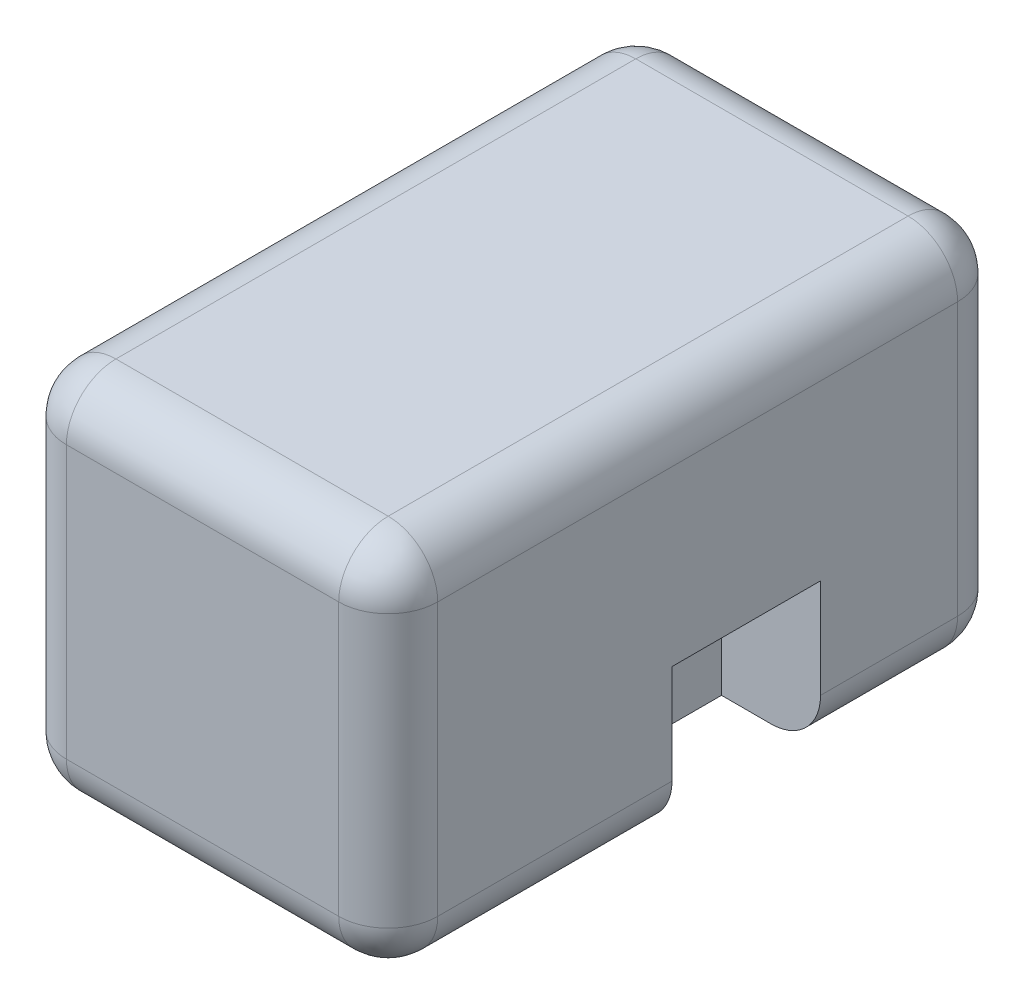
ISO-10303-21;
HEADER;
FILE_DESCRIPTION(('STEP AP214'),'2;1');
FILE_NAME('part.step','',(''),(''),'','','');
FILE_SCHEMA(('AUTOMOTIVE_DESIGN { 1 0 10303 214 1 1 1 1 }'));
ENDSEC;
DATA;
#1=APPLICATION_CONTEXT('core data for automotive mechanical design processes');
#2=APPLICATION_PROTOCOL_DEFINITION('international standard','automotive_design',2000,#1);
#3=PRODUCT_CONTEXT('',#1,'mechanical');
#4=PRODUCT('Part','Part','',(#3));
#5=PRODUCT_RELATED_PRODUCT_CATEGORY('part','',(#4));
#6=PRODUCT_DEFINITION_FORMATION('','',#4);
#7=PRODUCT_DEFINITION_CONTEXT('part definition',#1,'design');
#8=PRODUCT_DEFINITION('design','',#6,#7);
#9=PRODUCT_DEFINITION_SHAPE('','',#8);
#10=(LENGTH_UNIT() NAMED_UNIT(*) SI_UNIT(.MILLI.,.METRE.));
#11=(NAMED_UNIT(*) PLANE_ANGLE_UNIT() SI_UNIT($,.RADIAN.));
#12=(NAMED_UNIT(*) SI_UNIT($,.STERADIAN.) SOLID_ANGLE_UNIT());
#13=UNCERTAINTY_MEASURE_WITH_UNIT(LENGTH_MEASURE(1.E-05),#10,'distance_accuracy_value','');
#14=(GEOMETRIC_REPRESENTATION_CONTEXT(3) GLOBAL_UNCERTAINTY_ASSIGNED_CONTEXT((#13)) GLOBAL_UNIT_ASSIGNED_CONTEXT((#10,
#11,#12)) REPRESENTATION_CONTEXT('',''));
#15=CARTESIAN_POINT('',(0.,0.,0.));
#16=DIRECTION('',(0.,0.,1.));
#17=DIRECTION('',(1.,0.,0.));
#18=AXIS2_PLACEMENT_3D('',#15,#16,#17);
#19=CARTESIAN_POINT('',(20.,20.,250.));
#20=DIRECTION('',(0.,0.,-1.));
#21=DIRECTION('',(-1.,0.,0.));
#22=AXIS2_PLACEMENT_3D('',#19,#20,#21);
#23=CYLINDRICAL_SURFACE('',#22,20.);
#24=CARTESIAN_POINT('',(20.,20.,75.5178824316422));
#25=DIRECTION('',(0.,0.,-1.));
#26=DIRECTION('',(0.,1.,0.));
#27=AXIS2_PLACEMENT_3D('',#24,#25,#26);
#28=CIRCLE('',#27,20.);
#29=CARTESIAN_POINT('',(0.,20.,75.5178824316422));
#30=VERTEX_POINT('',#29);
#31=CARTESIAN_POINT('',(20.,0.,75.5178824316422));
#32=VERTEX_POINT('',#31);
#33=EDGE_CURVE('E11',#30,#32,#28,.F.);
#34=ORIENTED_EDGE('',*,*,#33,.F.);
#35=DIRECTION('',(0.,0.,-1.));
#36=VECTOR('',#35,1.);
#37=CARTESIAN_POINT('',(0.,20.,250.));
#38=LINE('',#37,#36);
#39=CARTESIAN_POINT('',(0.,20.,20.));
#40=VERTEX_POINT('',#39);
#41=EDGE_CURVE('E297',#40,#30,#38,.F.);
#42=ORIENTED_EDGE('',*,*,#41,.F.);
#43=CARTESIAN_POINT('',(20.,20.,20.));
#44=DIRECTION('',(0.,0.,-1.));
#45=DIRECTION('',(-1.,0.,0.));
#46=AXIS2_PLACEMENT_3D('',#43,#44,#45);
#47=CIRCLE('',#46,20.);
#48=CARTESIAN_POINT('',(20.,0.,20.));
#49=VERTEX_POINT('',#48);
#50=EDGE_CURVE('E359',#40,#49,#47,.F.);
#51=ORIENTED_EDGE('',*,*,#50,.T.);
#52=DIRECTION('',(0.,0.,-1.));
#53=VECTOR('',#52,1.);
#54=CARTESIAN_POINT('',(20.,0.,250.));
#55=LINE('',#54,#53);
#56=EDGE_CURVE('E282',#32,#49,#55,.T.);
#57=ORIENTED_EDGE('',*,*,#56,.F.);
#58=EDGE_LOOP('',(#34,#42,#51,#57));
#59=FACE_BOUND('',#58,.T.);
#60=ADVANCED_FACE('F32',(#59),#23,.T.);
#61=CARTESIAN_POINT('',(0.,0.,250.));
#62=DIRECTION('',(0.,1.,0.));
#63=DIRECTION('',(0.,0.,1.));
#64=AXIS2_PLACEMENT_3D('',#61,#62,#63);
#65=PLANE('',#64);
#66=DIRECTION('',(0.,0.,1.));
#67=VECTOR('',#66,1.);
#68=CARTESIAN_POINT('',(40.,0.,75.5178824316422));
#69=LINE('',#68,#67);
#70=CARTESIAN_POINT('',(40.,0.,75.5178824316422));
#71=VERTEX_POINT('',#70);
#72=CARTESIAN_POINT('',(40.,0.,135.517882431642));
#73=VERTEX_POINT('',#72);
#74=EDGE_CURVE('E196',#71,#73,#69,.T.);
#75=ORIENTED_EDGE('',*,*,#74,.F.);
#76=DIRECTION('',(-1.,0.,0.));
#77=VECTOR('',#76,1.);
#78=CARTESIAN_POINT('',(40.,0.,75.5178824316422));
#79=LINE('',#78,#77);
#80=EDGE_CURVE('E181',#71,#32,#79,.T.);
#81=ORIENTED_EDGE('',*,*,#80,.T.);
#82=ORIENTED_EDGE('',*,*,#56,.T.);
#83=DIRECTION('',(1.,0.,0.));
#84=VECTOR('',#83,1.);
#85=CARTESIAN_POINT('',(150.,0.,20.));
#86=LINE('',#85,#84);
#87=CARTESIAN_POINT('',(130.,0.,20.));
#88=VERTEX_POINT('',#87);
#89=EDGE_CURVE('E285',#49,#88,#86,.T.);
#90=ORIENTED_EDGE('',*,*,#89,.T.);
#91=DIRECTION('',(0.,0.,-1.));
#92=VECTOR('',#91,1.);
#93=CARTESIAN_POINT('',(130.,0.,250.));
#94=LINE('',#93,#92);
#95=CARTESIAN_POINT('',(130.,0.,75.3647620548374));
#96=VERTEX_POINT('',#95);
#97=EDGE_CURVE('E288',#88,#96,#94,.F.);
#98=ORIENTED_EDGE('',*,*,#97,.T.);
#99=DIRECTION('',(-1.,0.,0.));
#100=VECTOR('',#99,1.);
#101=CARTESIAN_POINT('',(0.,0.,75.3647620548374));
#102=LINE('',#101,#100);
#103=CARTESIAN_POINT('',(110.,0.,75.3647620548374));
#104=VERTEX_POINT('',#103);
#105=EDGE_CURVE('E55',#96,#104,#102,.T.);
#106=ORIENTED_EDGE('',*,*,#105,.T.);
#107=DIRECTION('',(0.,0.,-1.));
#108=VECTOR('',#107,1.);
#109=CARTESIAN_POINT('',(110.,0.,250.));
#110=LINE('',#109,#108);
#111=CARTESIAN_POINT('',(110.,0.,135.364762054837));
#112=VERTEX_POINT('',#111);
#113=EDGE_CURVE('E374',#112,#104,#110,.T.);
#114=ORIENTED_EDGE('',*,*,#113,.F.);
#115=DIRECTION('',(-1.,0.,0.));
#116=VECTOR('',#115,1.);
#117=CARTESIAN_POINT('',(0.,0.,135.364762054837));
#118=LINE('',#117,#116);
#119=CARTESIAN_POINT('',(130.,0.,135.364762054837));
#120=VERTEX_POINT('',#119);
#121=EDGE_CURVE('E240',#120,#112,#118,.T.);
#122=ORIENTED_EDGE('',*,*,#121,.F.);
#123=CARTESIAN_POINT('',(130.,0.,230.));
#124=VERTEX_POINT('',#123);
#125=EDGE_CURVE('E287',#120,#124,#94,.F.);
#126=ORIENTED_EDGE('',*,*,#125,.T.);
#127=DIRECTION('',(1.,0.,0.));
#128=VECTOR('',#127,1.);
#129=CARTESIAN_POINT('',(0.,0.,230.));
#130=LINE('',#129,#128);
#131=CARTESIAN_POINT('',(20.,0.,230.));
#132=VERTEX_POINT('',#131);
#133=EDGE_CURVE('E291',#124,#132,#130,.F.);
#134=ORIENTED_EDGE('',*,*,#133,.T.);
#135=CARTESIAN_POINT('',(20.,0.,135.517882431642));
#136=VERTEX_POINT('',#135);
#137=EDGE_CURVE('E283',#132,#136,#55,.T.);
#138=ORIENTED_EDGE('',*,*,#137,.T.);
#139=DIRECTION('',(-1.,0.,0.));
#140=VECTOR('',#139,1.);
#141=CARTESIAN_POINT('',(40.,0.,135.517882431642));
#142=LINE('',#141,#140);
#143=EDGE_CURVE('E47',#73,#136,#142,.T.);
#144=ORIENTED_EDGE('',*,*,#143,.F.);
#145=EDGE_LOOP('',(#75,#81,#82,#90,#98,#106,#114,#122,#126,#134,#138,#144));
#146=FACE_BOUND('',#145,.T.);
#147=ADVANCED_FACE('F200',(#146),#65,.F.);
#148=CARTESIAN_POINT('',(150.,0.,250.));
#149=DIRECTION('',(-1.,0.,0.));
#150=DIRECTION('',(0.,0.,1.));
#151=AXIS2_PLACEMENT_3D('',#148,#149,#150);
#152=PLANE('',#151);
#153=DIRECTION('',(0.,1.,0.));
#154=VECTOR('',#153,1.);
#155=CARTESIAN_POINT('',(150.,-19.9306992564541,135.364762054837));
#156=LINE('',#155,#154);
#157=CARTESIAN_POINT('',(150.,20.,135.364762054837));
#158=VERTEX_POINT('',#157);
#159=CARTESIAN_POINT('',(150.,60.0693007435459,135.364762054837));
#160=VERTEX_POINT('',#159);
#161=EDGE_CURVE('E223',#158,#160,#156,.T.);
#162=ORIENTED_EDGE('',*,*,#161,.T.);
#163=DIRECTION('',(0.,0.,-1.));
#164=VECTOR('',#163,1.);
#165=CARTESIAN_POINT('',(150.,60.0693007435459,135.364762054837));
#166=LINE('',#165,#164);
#167=CARTESIAN_POINT('',(150.,60.0693007435459,75.3647620548374));
#168=VERTEX_POINT('',#167);
#169=EDGE_CURVE('E230',#160,#168,#166,.T.);
#170=ORIENTED_EDGE('',*,*,#169,.T.);
#171=DIRECTION('',(0.,1.,0.));
#172=VECTOR('',#171,1.);
#173=CARTESIAN_POINT('',(150.,-19.9306992564541,75.3647620548374));
#174=LINE('',#173,#172);
#175=CARTESIAN_POINT('',(150.,20.,75.3647620548374));
#176=VERTEX_POINT('',#175);
#177=EDGE_CURVE('E215',#176,#168,#174,.T.);
#178=ORIENTED_EDGE('',*,*,#177,.F.);
#179=DIRECTION('',(0.,0.,-1.));
#180=VECTOR('',#179,1.);
#181=CARTESIAN_POINT('',(150.,20.,250.));
#182=LINE('',#181,#180);
#183=CARTESIAN_POINT('',(150.,20.,20.));
#184=VERTEX_POINT('',#183);
#185=EDGE_CURVE('E253',#176,#184,#182,.T.);
#186=ORIENTED_EDGE('',*,*,#185,.T.);
#187=DIRECTION('',(0.,1.,0.));
#188=VECTOR('',#187,1.);
#189=CARTESIAN_POINT('',(150.,150.,20.));
#190=LINE('',#189,#188);
#191=CARTESIAN_POINT('',(150.,130.,20.));
#192=VERTEX_POINT('',#191);
#193=EDGE_CURVE('E257',#184,#192,#190,.T.);
#194=ORIENTED_EDGE('',*,*,#193,.T.);
#195=DIRECTION('',(0.,0.,-1.));
#196=VECTOR('',#195,1.);
#197=CARTESIAN_POINT('',(150.,130.,250.));
#198=LINE('',#197,#196);
#199=CARTESIAN_POINT('',(150.,130.,230.));
#200=VERTEX_POINT('',#199);
#201=EDGE_CURVE('E262',#192,#200,#198,.F.);
#202=ORIENTED_EDGE('',*,*,#201,.T.);
#203=DIRECTION('',(0.,1.,0.));
#204=VECTOR('',#203,1.);
#205=CARTESIAN_POINT('',(150.,0.,230.));
#206=LINE('',#205,#204);
#207=CARTESIAN_POINT('',(150.,20.,230.));
#208=VERTEX_POINT('',#207);
#209=EDGE_CURVE('E259',#200,#208,#206,.F.);
#210=ORIENTED_EDGE('',*,*,#209,.T.);
#211=EDGE_CURVE('E254',#208,#158,#182,.T.);
#212=ORIENTED_EDGE('',*,*,#211,.T.);
#213=EDGE_LOOP('',(#162,#170,#178,#186,#194,#202,#210,#212));
#214=FACE_BOUND('',#213,.T.);
#215=ADVANCED_FACE('F433',(#214),#152,.F.);
#216=CARTESIAN_POINT('',(130.,20.,250.));
#217=DIRECTION('',(0.,0.,-1.));
#218=DIRECTION('',(-1.,0.,0.));
#219=AXIS2_PLACEMENT_3D('',#216,#217,#218);
#220=CYLINDRICAL_SURFACE('',#219,20.);
#221=ORIENTED_EDGE('',*,*,#125,.F.);
#222=CARTESIAN_POINT('',(130.,20.,135.364762054837));
#223=DIRECTION('',(0.,0.,-1.));
#224=DIRECTION('',(-1.,0.,0.));
#225=AXIS2_PLACEMENT_3D('',#222,#223,#224);
#226=CIRCLE('',#225,20.);
#227=EDGE_CURVE('E371',#120,#158,#226,.F.);
#228=ORIENTED_EDGE('',*,*,#227,.T.);
#229=ORIENTED_EDGE('',*,*,#211,.F.);
#230=CARTESIAN_POINT('',(130.,20.,230.));
#231=DIRECTION('',(0.,0.,1.));
#232=DIRECTION('',(1.,0.,0.));
#233=AXIS2_PLACEMENT_3D('',#230,#231,#232);
#234=CIRCLE('',#233,20.);
#235=EDGE_CURVE('E318',#124,#208,#234,.T.);
#236=ORIENTED_EDGE('',*,*,#235,.F.);
#237=EDGE_LOOP('',(#221,#228,#229,#236));
#238=FACE_BOUND('',#237,.T.);
#239=ADVANCED_FACE('F450',(#238),#220,.T.);
#240=CARTESIAN_POINT('',(0.,0.,250.));
#241=DIRECTION('',(1.,0.,0.));
#242=DIRECTION('',(0.,0.,-1.));
#243=AXIS2_PLACEMENT_3D('',#240,#241,#242);
#244=PLANE('',#243);
#245=ORIENTED_EDGE('',*,*,#41,.T.);
#246=DIRECTION('',(0.,-1.,0.));
#247=VECTOR('',#246,1.);
#248=CARTESIAN_POINT('',(0.,60.,75.5178824316422));
#249=LINE('',#248,#247);
#250=CARTESIAN_POINT('',(0.,60.,75.5178824316422));
#251=VERTEX_POINT('',#250);
#252=EDGE_CURVE('E207',#251,#30,#249,.T.);
#253=ORIENTED_EDGE('',*,*,#252,.F.);
#254=DIRECTION('',(0.,0.,-1.));
#255=VECTOR('',#254,1.);
#256=CARTESIAN_POINT('',(0.,60.,75.5178824316422));
#257=LINE('',#256,#255);
#258=CARTESIAN_POINT('',(0.,60.,135.517882431642));
#259=VERTEX_POINT('',#258);
#260=EDGE_CURVE('E198',#259,#251,#257,.T.);
#261=ORIENTED_EDGE('',*,*,#260,.F.);
#262=DIRECTION('',(0.,1.,0.));
#263=VECTOR('',#262,1.);
#264=CARTESIAN_POINT('',(0.,60.,135.517882431642));
#265=LINE('',#264,#263);
#266=CARTESIAN_POINT('',(0.,20.,135.517882431642));
#267=VERTEX_POINT('',#266);
#268=EDGE_CURVE('E209',#267,#259,#265,.T.);
#269=ORIENTED_EDGE('',*,*,#268,.F.);
#270=CARTESIAN_POINT('',(0.,20.,230.));
#271=VERTEX_POINT('',#270);
#272=EDGE_CURVE('E296',#267,#271,#38,.F.);
#273=ORIENTED_EDGE('',*,*,#272,.T.);
#274=DIRECTION('',(0.,-1.,0.));
#275=VECTOR('',#274,1.);
#276=CARTESIAN_POINT('',(0.,0.,230.));
#277=LINE('',#276,#275);
#278=CARTESIAN_POINT('',(0.,130.,230.));
#279=VERTEX_POINT('',#278);
#280=EDGE_CURVE('E300',#271,#279,#277,.F.);
#281=ORIENTED_EDGE('',*,*,#280,.T.);
#282=DIRECTION('',(0.,0.,-1.));
#283=VECTOR('',#282,1.);
#284=CARTESIAN_POINT('',(0.,130.,250.));
#285=LINE('',#284,#283);
#286=CARTESIAN_POINT('',(0.,130.,20.));
#287=VERTEX_POINT('',#286);
#288=EDGE_CURVE('E302',#279,#287,#285,.T.);
#289=ORIENTED_EDGE('',*,*,#288,.T.);
#290=DIRECTION('',(0.,-1.,0.));
#291=VECTOR('',#290,1.);
#292=CARTESIAN_POINT('',(0.,0.,20.));
#293=LINE('',#292,#291);
#294=EDGE_CURVE('E294',#287,#40,#293,.T.);
#295=ORIENTED_EDGE('',*,*,#294,.T.);
#296=EDGE_LOOP('',(#245,#253,#261,#269,#273,#281,#289,#295));
#297=FACE_BOUND('',#296,.T.);
#298=ADVANCED_FACE('F382',(#297),#244,.F.);
#299=CARTESIAN_POINT('',(0.,150.,250.));
#300=DIRECTION('',(0.,-1.,0.));
#301=DIRECTION('',(0.,0.,-1.));
#302=AXIS2_PLACEMENT_3D('',#299,#300,#301);
#303=PLANE('',#302);
#304=DIRECTION('',(-1.,0.,0.));
#305=VECTOR('',#304,1.);
#306=CARTESIAN_POINT('',(0.,150.,230.));
#307=LINE('',#306,#305);
#308=CARTESIAN_POINT('',(20.,150.,230.));
#309=VERTEX_POINT('',#308);
#310=CARTESIAN_POINT('',(130.,150.,230.));
#311=VERTEX_POINT('',#310);
#312=EDGE_CURVE('E277',#309,#311,#307,.F.);
#313=ORIENTED_EDGE('',*,*,#312,.T.);
#314=DIRECTION('',(0.,0.,-1.));
#315=VECTOR('',#314,1.);
#316=CARTESIAN_POINT('',(130.,150.,250.));
#317=LINE('',#316,#315);
#318=CARTESIAN_POINT('',(130.,150.,20.));
#319=VERTEX_POINT('',#318);
#320=EDGE_CURVE('E279',#311,#319,#317,.T.);
#321=ORIENTED_EDGE('',*,*,#320,.T.);
#322=DIRECTION('',(-1.,0.,0.));
#323=VECTOR('',#322,1.);
#324=CARTESIAN_POINT('',(0.,150.,20.));
#325=LINE('',#324,#323);
#326=CARTESIAN_POINT('',(20.,150.,20.));
#327=VERTEX_POINT('',#326);
#328=EDGE_CURVE('E275',#319,#327,#325,.T.);
#329=ORIENTED_EDGE('',*,*,#328,.T.);
#330=DIRECTION('',(0.,0.,-1.));
#331=VECTOR('',#330,1.);
#332=CARTESIAN_POINT('',(20.,150.,250.));
#333=LINE('',#332,#331);
#334=EDGE_CURVE('E273',#327,#309,#333,.F.);
#335=ORIENTED_EDGE('',*,*,#334,.T.);
#336=EDGE_LOOP('',(#313,#321,#329,#335));
#337=FACE_BOUND('',#336,.T.);
#338=ADVANCED_FACE('F520',(#337),#303,.F.);
#339=CARTESIAN_POINT('',(0.,0.,250.));
#340=DIRECTION('',(0.,0.,-1.));
#341=DIRECTION('',(-1.,0.,0.));
#342=AXIS2_PLACEMENT_3D('',#339,#340,#341);
#343=PLANE('',#342);
#344=DIRECTION('',(1.,0.,0.));
#345=VECTOR('',#344,1.);
#346=CARTESIAN_POINT('',(0.,20.,250.));
#347=LINE('',#346,#345);
#348=CARTESIAN_POINT('',(20.,20.,250.));
#349=VERTEX_POINT('',#348);
#350=CARTESIAN_POINT('',(130.,20.,250.));
#351=VERTEX_POINT('',#350);
#352=EDGE_CURVE('E245',#349,#351,#347,.T.);
#353=ORIENTED_EDGE('',*,*,#352,.T.);
#354=DIRECTION('',(0.,1.,0.));
#355=VECTOR('',#354,1.);
#356=CARTESIAN_POINT('',(130.,0.,250.));
#357=LINE('',#356,#355);
#358=CARTESIAN_POINT('',(130.,130.,250.));
#359=VERTEX_POINT('',#358);
#360=EDGE_CURVE('E250',#351,#359,#357,.T.);
#361=ORIENTED_EDGE('',*,*,#360,.T.);
#362=DIRECTION('',(-1.,0.,0.));
#363=VECTOR('',#362,1.);
#364=CARTESIAN_POINT('',(0.,130.,250.));
#365=LINE('',#364,#363);
#366=CARTESIAN_POINT('',(20.,130.,250.));
#367=VERTEX_POINT('',#366);
#368=EDGE_CURVE('E248',#359,#367,#365,.T.);
#369=ORIENTED_EDGE('',*,*,#368,.T.);
#370=DIRECTION('',(0.,-1.,0.));
#371=VECTOR('',#370,1.);
#372=CARTESIAN_POINT('',(20.,0.,250.));
#373=LINE('',#372,#371);
#374=EDGE_CURVE('E243',#367,#349,#373,.T.);
#375=ORIENTED_EDGE('',*,*,#374,.T.);
#376=EDGE_LOOP('',(#353,#361,#369,#375));
#377=FACE_BOUND('',#376,.T.);
#378=ADVANCED_FACE('F468',(#377),#343,.F.);
#379=CARTESIAN_POINT('',(0.,0.,0.));
#380=DIRECTION('',(0.,0.,-1.));
#381=DIRECTION('',(-1.,0.,0.));
#382=AXIS2_PLACEMENT_3D('',#379,#380,#381);
#383=PLANE('',#382);
#384=DIRECTION('',(-1.,0.,0.));
#385=VECTOR('',#384,1.);
#386=CARTESIAN_POINT('',(150.,130.,0.));
#387=LINE('',#386,#385);
#388=CARTESIAN_POINT('',(20.,130.,0.));
#389=VERTEX_POINT('',#388);
#390=CARTESIAN_POINT('',(130.,130.,0.));
#391=VERTEX_POINT('',#390);
#392=EDGE_CURVE('E268',#389,#391,#387,.F.);
#393=ORIENTED_EDGE('',*,*,#392,.T.);
#394=DIRECTION('',(0.,1.,0.));
#395=VECTOR('',#394,1.);
#396=CARTESIAN_POINT('',(130.,0.,0.));
#397=LINE('',#396,#395);
#398=CARTESIAN_POINT('',(130.,20.,0.));
#399=VERTEX_POINT('',#398);
#400=EDGE_CURVE('E270',#391,#399,#397,.F.);
#401=ORIENTED_EDGE('',*,*,#400,.T.);
#402=DIRECTION('',(1.,0.,0.));
#403=VECTOR('',#402,1.);
#404=CARTESIAN_POINT('',(0.,20.,0.));
#405=LINE('',#404,#403);
#406=CARTESIAN_POINT('',(20.,20.,0.));
#407=VERTEX_POINT('',#406);
#408=EDGE_CURVE('E266',#399,#407,#405,.F.);
#409=ORIENTED_EDGE('',*,*,#408,.T.);
#410=DIRECTION('',(0.,-1.,0.));
#411=VECTOR('',#410,1.);
#412=CARTESIAN_POINT('',(20.,150.,0.));
#413=LINE('',#412,#411);
#414=EDGE_CURVE('E264',#407,#389,#413,.F.);
#415=ORIENTED_EDGE('',*,*,#414,.T.);
#416=EDGE_LOOP('',(#393,#401,#409,#415));
#417=FACE_BOUND('',#416,.T.);
#418=ADVANCED_FACE('F511',(#417),#383,.T.);
#419=CARTESIAN_POINT('',(20.,0.,20.));
#420=DIRECTION('',(0.,1.,0.));
#421=DIRECTION('',(0.,0.,1.));
#422=AXIS2_PLACEMENT_3D('',#419,#420,#421);
#423=CYLINDRICAL_SURFACE('',#422,20.);
#424=CARTESIAN_POINT('',(20.,20.,20.));
#425=DIRECTION('',(0.,-1.,0.));
#426=DIRECTION('',(0.,0.,-1.));
#427=AXIS2_PLACEMENT_3D('',#424,#425,#426);
#428=CIRCLE('',#427,20.);
#429=EDGE_CURVE('E246',#40,#407,#428,.T.);
#430=ORIENTED_EDGE('',*,*,#429,.F.);
#431=ORIENTED_EDGE('',*,*,#294,.F.);
#432=CARTESIAN_POINT('',(20.,130.,20.));
#433=DIRECTION('',(0.,1.,0.));
#434=DIRECTION('',(0.,0.,1.));
#435=AXIS2_PLACEMENT_3D('',#432,#433,#434);
#436=CIRCLE('',#435,20.);
#437=EDGE_CURVE('E365',#389,#287,#436,.T.);
#438=ORIENTED_EDGE('',*,*,#437,.F.);
#439=ORIENTED_EDGE('',*,*,#414,.F.);
#440=EDGE_LOOP('',(#430,#431,#438,#439));
#441=FACE_BOUND('',#440,.T.);
#442=ADVANCED_FACE('F34',(#441),#423,.T.);
#443=CARTESIAN_POINT('',(20.,20.,20.));
#444=DIRECTION('',(0.,0.,-1.));
#445=DIRECTION('',(-1.,0.,0.));
#446=AXIS2_PLACEMENT_3D('',#443,#444,#445);
#447=SPHERICAL_SURFACE('',#446,20.);
#448=ORIENTED_EDGE('',*,*,#50,.F.);
#449=ORIENTED_EDGE('',*,*,#429,.T.);
#450=CARTESIAN_POINT('',(20.,20.,20.));
#451=DIRECTION('',(-1.,0.,0.));
#452=DIRECTION('',(0.,0.,1.));
#453=AXIS2_PLACEMENT_3D('',#450,#451,#452);
#454=CIRCLE('',#453,20.);
#455=EDGE_CURVE('E362',#49,#407,#454,.F.);
#456=ORIENTED_EDGE('',*,*,#455,.F.);
#457=EDGE_LOOP('',(#448,#449,#456));
#458=FACE_BOUND('',#457,.T.);
#459=ADVANCED_FACE('F504',(#458),#447,.T.);
#460=CARTESIAN_POINT('',(20.,130.,20.));
#461=DIRECTION('',(-1.,0.,0.));
#462=DIRECTION('',(0.,0.,1.));
#463=AXIS2_PLACEMENT_3D('',#460,#461,#462);
#464=SPHERICAL_SURFACE('',#463,20.);
#465=CARTESIAN_POINT('',(20.,130.,20.));
#466=DIRECTION('',(-1.,0.,0.));
#467=DIRECTION('',(0.,0.,1.));
#468=AXIS2_PLACEMENT_3D('',#465,#466,#467);
#469=CIRCLE('',#468,20.);
#470=EDGE_CURVE('E354',#389,#327,#469,.F.);
#471=ORIENTED_EDGE('',*,*,#470,.F.);
#472=ORIENTED_EDGE('',*,*,#437,.T.);
#473=CARTESIAN_POINT('',(20.,130.,20.));
#474=DIRECTION('',(0.,0.,-1.));
#475=DIRECTION('',(-1.,0.,0.));
#476=AXIS2_PLACEMENT_3D('',#473,#474,#475);
#477=CIRCLE('',#476,20.);
#478=EDGE_CURVE('E357',#327,#287,#477,.F.);
#479=ORIENTED_EDGE('',*,*,#478,.F.);
#480=EDGE_LOOP('',(#471,#472,#479));
#481=FACE_BOUND('',#480,.T.);
#482=ADVANCED_FACE('F407',(#481),#464,.T.);
#483=CARTESIAN_POINT('',(0.,20.,20.));
#484=DIRECTION('',(-1.,0.,0.));
#485=DIRECTION('',(0.,0.,1.));
#486=AXIS2_PLACEMENT_3D('',#483,#484,#485);
#487=CYLINDRICAL_SURFACE('',#486,20.);
#488=ORIENTED_EDGE('',*,*,#455,.T.);
#489=ORIENTED_EDGE('',*,*,#408,.F.);
#490=CARTESIAN_POINT('',(130.,20.,20.));
#491=DIRECTION('',(1.,0.,0.));
#492=DIRECTION('',(0.,0.,-1.));
#493=AXIS2_PLACEMENT_3D('',#490,#491,#492);
#494=CIRCLE('',#493,20.);
#495=EDGE_CURVE('E349',#88,#399,#494,.T.);
#496=ORIENTED_EDGE('',*,*,#495,.F.);
#497=ORIENTED_EDGE('',*,*,#89,.F.);
#498=EDGE_LOOP('',(#488,#489,#496,#497));
#499=FACE_BOUND('',#498,.T.);
#500=ADVANCED_FACE('F422',(#499),#487,.T.);
#501=CARTESIAN_POINT('',(20.,20.,135.517882431642));
#502=DIRECTION('',(0.,0.,1.));
#503=DIRECTION('',(1.,0.,0.));
#504=AXIS2_PLACEMENT_3D('',#501,#502,#503);
#505=CIRCLE('',#504,20.);
#506=EDGE_CURVE('E40',#136,#267,#505,.F.);
#507=ORIENTED_EDGE('',*,*,#506,.F.);
#508=ORIENTED_EDGE('',*,*,#137,.F.);
#509=CARTESIAN_POINT('',(20.,20.,230.));
#510=DIRECTION('',(0.,0.,1.));
#511=DIRECTION('',(1.,0.,0.));
#512=AXIS2_PLACEMENT_3D('',#509,#510,#511);
#513=CIRCLE('',#512,20.);
#514=EDGE_CURVE('E346',#271,#132,#513,.T.);
#515=ORIENTED_EDGE('',*,*,#514,.F.);
#516=ORIENTED_EDGE('',*,*,#272,.F.);
#517=EDGE_LOOP('',(#507,#508,#515,#516));
#518=FACE_BOUND('',#517,.T.);
#519=ADVANCED_FACE('F386',(#518),#23,.T.);
#520=CARTESIAN_POINT('',(20.,0.,230.));
#521=DIRECTION('',(0.,-1.,0.));
#522=DIRECTION('',(0.,0.,-1.));
#523=AXIS2_PLACEMENT_3D('',#520,#521,#522);
#524=CYLINDRICAL_SURFACE('',#523,20.);
#525=CARTESIAN_POINT('',(20.,130.,230.));
#526=DIRECTION('',(0.,1.,0.));
#527=DIRECTION('',(0.,0.,1.));
#528=AXIS2_PLACEMENT_3D('',#525,#526,#527);
#529=CIRCLE('',#528,20.);
#530=EDGE_CURVE('E340',#279,#367,#529,.T.);
#531=ORIENTED_EDGE('',*,*,#530,.F.);
#532=ORIENTED_EDGE('',*,*,#280,.F.);
#533=CARTESIAN_POINT('',(20.,20.,230.));
#534=DIRECTION('',(0.,-1.,0.));
#535=DIRECTION('',(0.,0.,-1.));
#536=AXIS2_PLACEMENT_3D('',#533,#534,#535);
#537=CIRCLE('',#536,20.);
#538=EDGE_CURVE('E343',#349,#271,#537,.T.);
#539=ORIENTED_EDGE('',*,*,#538,.F.);
#540=ORIENTED_EDGE('',*,*,#374,.F.);
#541=EDGE_LOOP('',(#531,#532,#539,#540));
#542=FACE_BOUND('',#541,.T.);
#543=ADVANCED_FACE('F395',(#542),#524,.T.);
#544=CARTESIAN_POINT('',(20.,130.,250.));
#545=DIRECTION('',(0.,0.,-1.));
#546=DIRECTION('',(-1.,0.,0.));
#547=AXIS2_PLACEMENT_3D('',#544,#545,#546);
#548=CYLINDRICAL_SURFACE('',#547,20.);
#549=ORIENTED_EDGE('',*,*,#478,.T.);
#550=ORIENTED_EDGE('',*,*,#288,.F.);
#551=CARTESIAN_POINT('',(20.,130.,230.));
#552=DIRECTION('',(0.,0.,1.));
#553=DIRECTION('',(1.,0.,0.));
#554=AXIS2_PLACEMENT_3D('',#551,#552,#553);
#555=CIRCLE('',#554,20.);
#556=EDGE_CURVE('E337',#309,#279,#555,.T.);
#557=ORIENTED_EDGE('',*,*,#556,.F.);
#558=ORIENTED_EDGE('',*,*,#334,.F.);
#559=EDGE_LOOP('',(#549,#550,#557,#558));
#560=FACE_BOUND('',#559,.T.);
#561=ADVANCED_FACE('F399',(#560),#548,.T.);
#562=CARTESIAN_POINT('',(0.,130.,20.));
#563=DIRECTION('',(1.,0.,0.));
#564=DIRECTION('',(0.,0.,-1.));
#565=AXIS2_PLACEMENT_3D('',#562,#563,#564);
#566=CYLINDRICAL_SURFACE('',#565,20.);
#567=ORIENTED_EDGE('',*,*,#470,.T.);
#568=ORIENTED_EDGE('',*,*,#328,.F.);
#569=CARTESIAN_POINT('',(130.,130.,20.));
#570=DIRECTION('',(1.,0.,0.));
#571=DIRECTION('',(0.,0.,-1.));
#572=AXIS2_PLACEMENT_3D('',#569,#570,#571);
#573=CIRCLE('',#572,20.);
#574=EDGE_CURVE('E334',#391,#319,#573,.T.);
#575=ORIENTED_EDGE('',*,*,#574,.F.);
#576=ORIENTED_EDGE('',*,*,#392,.F.);
#577=EDGE_LOOP('',(#567,#568,#575,#576));
#578=FACE_BOUND('',#577,.T.);
#579=ADVANCED_FACE('F696',(#578),#566,.T.);
#580=CARTESIAN_POINT('',(130.,0.,20.));
#581=DIRECTION('',(0.,-1.,0.));
#582=DIRECTION('',(0.,0.,-1.));
#583=AXIS2_PLACEMENT_3D('',#580,#581,#582);
#584=CYLINDRICAL_SURFACE('',#583,20.);
#585=CARTESIAN_POINT('',(130.,20.,20.));
#586=DIRECTION('',(0.,-1.,0.));
#587=DIRECTION('',(0.,0.,-1.));
#588=AXIS2_PLACEMENT_3D('',#585,#586,#587);
#589=CIRCLE('',#588,20.);
#590=EDGE_CURVE('E351',#399,#184,#589,.T.);
#591=ORIENTED_EDGE('',*,*,#590,.F.);
#592=ORIENTED_EDGE('',*,*,#400,.F.);
#593=CARTESIAN_POINT('',(130.,130.,20.));
#594=DIRECTION('',(0.,1.,0.));
#595=DIRECTION('',(0.,0.,1.));
#596=AXIS2_PLACEMENT_3D('',#593,#594,#595);
#597=CIRCLE('',#596,20.);
#598=EDGE_CURVE('E331',#192,#391,#597,.T.);
#599=ORIENTED_EDGE('',*,*,#598,.F.);
#600=ORIENTED_EDGE('',*,*,#193,.F.);
#601=EDGE_LOOP('',(#591,#592,#599,#600));
#602=FACE_BOUND('',#601,.T.);
#603=ADVANCED_FACE('F688',(#602),#584,.T.);
#604=CARTESIAN_POINT('',(130.,20.,20.));
#605=DIRECTION('',(0.,0.,-1.));
#606=DIRECTION('',(-1.,0.,0.));
#607=AXIS2_PLACEMENT_3D('',#604,#605,#606);
#608=SPHERICAL_SURFACE('',#607,20.);
#609=ORIENTED_EDGE('',*,*,#495,.T.);
#610=ORIENTED_EDGE('',*,*,#590,.T.);
#611=CARTESIAN_POINT('',(130.,20.,20.));
#612=DIRECTION('',(0.,0.,-1.));
#613=DIRECTION('',(-1.,0.,0.));
#614=AXIS2_PLACEMENT_3D('',#611,#612,#613);
#615=CIRCLE('',#614,20.);
#616=EDGE_CURVE('E328',#88,#184,#615,.F.);
#617=ORIENTED_EDGE('',*,*,#616,.F.);
#618=EDGE_LOOP('',(#609,#610,#617));
#619=FACE_BOUND('',#618,.T.);
#620=ADVANCED_FACE('F425',(#619),#608,.T.);
#621=CARTESIAN_POINT('',(20.,20.,230.));
#622=DIRECTION('',(-1.,0.,0.));
#623=DIRECTION('',(0.,0.,1.));
#624=AXIS2_PLACEMENT_3D('',#621,#622,#623);
#625=SPHERICAL_SURFACE('',#624,20.);
#626=ORIENTED_EDGE('',*,*,#538,.T.);
#627=ORIENTED_EDGE('',*,*,#514,.T.);
#628=CARTESIAN_POINT('',(20.,20.,230.));
#629=DIRECTION('',(-1.,0.,0.));
#630=DIRECTION('',(0.,0.,1.));
#631=AXIS2_PLACEMENT_3D('',#628,#629,#630);
#632=CIRCLE('',#631,20.);
#633=EDGE_CURVE('E326',#349,#132,#632,.F.);
#634=ORIENTED_EDGE('',*,*,#633,.F.);
#635=EDGE_LOOP('',(#626,#627,#634));
#636=FACE_BOUND('',#635,.T.);
#637=ADVANCED_FACE('F390',(#636),#625,.T.);
#638=CARTESIAN_POINT('',(20.,130.,230.));
#639=DIRECTION('',(-1.,0.,0.));
#640=DIRECTION('',(0.,0.,1.));
#641=AXIS2_PLACEMENT_3D('',#638,#639,#640);
#642=SPHERICAL_SURFACE('',#641,20.);
#643=ORIENTED_EDGE('',*,*,#556,.T.);
#644=ORIENTED_EDGE('',*,*,#530,.T.);
#645=CARTESIAN_POINT('',(20.,130.,230.));
#646=DIRECTION('',(-1.,0.,0.));
#647=DIRECTION('',(0.,0.,1.));
#648=AXIS2_PLACEMENT_3D('',#645,#646,#647);
#649=CIRCLE('',#648,20.);
#650=EDGE_CURVE('E323',#309,#367,#649,.F.);
#651=ORIENTED_EDGE('',*,*,#650,.F.);
#652=EDGE_LOOP('',(#643,#644,#651));
#653=FACE_BOUND('',#652,.T.);
#654=ADVANCED_FACE('F664',(#653),#642,.T.);
#655=CARTESIAN_POINT('',(130.,130.,20.));
#656=DIRECTION('',(0.,0.,-1.));
#657=DIRECTION('',(-1.,0.,0.));
#658=AXIS2_PLACEMENT_3D('',#655,#656,#657);
#659=SPHERICAL_SURFACE('',#658,20.);
#660=ORIENTED_EDGE('',*,*,#598,.T.);
#661=ORIENTED_EDGE('',*,*,#574,.T.);
#662=CARTESIAN_POINT('',(130.,130.,20.));
#663=DIRECTION('',(0.,0.,-1.));
#664=DIRECTION('',(-1.,0.,0.));
#665=AXIS2_PLACEMENT_3D('',#662,#663,#664);
#666=CIRCLE('',#665,20.);
#667=EDGE_CURVE('E321',#192,#319,#666,.F.);
#668=ORIENTED_EDGE('',*,*,#667,.F.);
#669=EDGE_LOOP('',(#660,#661,#668));
#670=FACE_BOUND('',#669,.T.);
#671=ADVANCED_FACE('F658',(#670),#659,.T.);
#672=CARTESIAN_POINT('',(130.,20.,75.3647620548374));
#673=DIRECTION('',(0.,0.,-1.));
#674=DIRECTION('',(-1.,0.,0.));
#675=AXIS2_PLACEMENT_3D('',#672,#673,#674);
#676=CIRCLE('',#675,20.);
#677=EDGE_CURVE('E305',#96,#176,#676,.F.);
#678=ORIENTED_EDGE('',*,*,#677,.F.);
#679=ORIENTED_EDGE('',*,*,#97,.F.);
#680=ORIENTED_EDGE('',*,*,#616,.T.);
#681=ORIENTED_EDGE('',*,*,#185,.F.);
#682=EDGE_LOOP('',(#678,#679,#680,#681));
#683=FACE_BOUND('',#682,.T.);
#684=ADVANCED_FACE('F428',(#683),#220,.T.);
#685=CARTESIAN_POINT('',(0.,20.,230.));
#686=DIRECTION('',(1.,0.,0.));
#687=DIRECTION('',(0.,0.,-1.));
#688=AXIS2_PLACEMENT_3D('',#685,#686,#687);
#689=CYLINDRICAL_SURFACE('',#688,20.);
#690=ORIENTED_EDGE('',*,*,#633,.T.);
#691=ORIENTED_EDGE('',*,*,#133,.F.);
#692=CARTESIAN_POINT('',(130.,20.,230.));
#693=DIRECTION('',(1.,0.,0.));
#694=DIRECTION('',(0.,0.,-1.));
#695=AXIS2_PLACEMENT_3D('',#692,#693,#694);
#696=CIRCLE('',#695,20.);
#697=EDGE_CURVE('E315',#351,#124,#696,.T.);
#698=ORIENTED_EDGE('',*,*,#697,.F.);
#699=ORIENTED_EDGE('',*,*,#352,.F.);
#700=EDGE_LOOP('',(#690,#691,#698,#699));
#701=FACE_BOUND('',#700,.T.);
#702=ADVANCED_FACE('F472',(#701),#689,.T.);
#703=CARTESIAN_POINT('',(0.,130.,230.));
#704=DIRECTION('',(-1.,0.,0.));
#705=DIRECTION('',(0.,0.,1.));
#706=AXIS2_PLACEMENT_3D('',#703,#704,#705);
#707=CYLINDRICAL_SURFACE('',#706,20.);
#708=ORIENTED_EDGE('',*,*,#650,.T.);
#709=ORIENTED_EDGE('',*,*,#368,.F.);
#710=CARTESIAN_POINT('',(130.,130.,230.));
#711=DIRECTION('',(1.,0.,0.));
#712=DIRECTION('',(0.,0.,-1.));
#713=AXIS2_PLACEMENT_3D('',#710,#711,#712);
#714=CIRCLE('',#713,20.);
#715=EDGE_CURVE('E312',#311,#359,#714,.T.);
#716=ORIENTED_EDGE('',*,*,#715,.F.);
#717=ORIENTED_EDGE('',*,*,#312,.F.);
#718=EDGE_LOOP('',(#708,#709,#716,#717));
#719=FACE_BOUND('',#718,.T.);
#720=ADVANCED_FACE('F466',(#719),#707,.T.);
#721=CARTESIAN_POINT('',(130.,130.,250.));
#722=DIRECTION('',(0.,0.,-1.));
#723=DIRECTION('',(-1.,0.,0.));
#724=AXIS2_PLACEMENT_3D('',#721,#722,#723);
#725=CYLINDRICAL_SURFACE('',#724,20.);
#726=ORIENTED_EDGE('',*,*,#667,.T.);
#727=ORIENTED_EDGE('',*,*,#320,.F.);
#728=CARTESIAN_POINT('',(130.,130.,230.));
#729=DIRECTION('',(0.,0.,1.));
#730=DIRECTION('',(1.,0.,0.));
#731=AXIS2_PLACEMENT_3D('',#728,#729,#730);
#732=CIRCLE('',#731,20.);
#733=EDGE_CURVE('E309',#200,#311,#732,.T.);
#734=ORIENTED_EDGE('',*,*,#733,.F.);
#735=ORIENTED_EDGE('',*,*,#201,.F.);
#736=EDGE_LOOP('',(#726,#727,#734,#735));
#737=FACE_BOUND('',#736,.T.);
#738=ADVANCED_FACE('F476',(#737),#725,.T.);
#739=CARTESIAN_POINT('',(130.,20.,230.));
#740=DIRECTION('',(0.,-1.,0.));
#741=DIRECTION('',(0.,0.,-1.));
#742=AXIS2_PLACEMENT_3D('',#739,#740,#741);
#743=SPHERICAL_SURFACE('',#742,20.);
#744=ORIENTED_EDGE('',*,*,#697,.T.);
#745=ORIENTED_EDGE('',*,*,#235,.T.);
#746=CARTESIAN_POINT('',(130.,20.,230.));
#747=DIRECTION('',(0.,-1.,0.));
#748=DIRECTION('',(0.,0.,-1.));
#749=AXIS2_PLACEMENT_3D('',#746,#747,#748);
#750=CIRCLE('',#749,20.);
#751=EDGE_CURVE('E307',#351,#208,#750,.F.);
#752=ORIENTED_EDGE('',*,*,#751,.F.);
#753=EDGE_LOOP('',(#744,#745,#752));
#754=FACE_BOUND('',#753,.T.);
#755=ADVANCED_FACE('F474',(#754),#743,.T.);
#756=CARTESIAN_POINT('',(130.,130.,230.));
#757=DIRECTION('',(0.,1.,0.));
#758=DIRECTION('',(0.,0.,1.));
#759=AXIS2_PLACEMENT_3D('',#756,#757,#758);
#760=SPHERICAL_SURFACE('',#759,20.);
#761=ORIENTED_EDGE('',*,*,#733,.T.);
#762=ORIENTED_EDGE('',*,*,#715,.T.);
#763=CARTESIAN_POINT('',(130.,130.,230.));
#764=DIRECTION('',(0.,1.,0.));
#765=DIRECTION('',(0.,0.,1.));
#766=AXIS2_PLACEMENT_3D('',#763,#764,#765);
#767=CIRCLE('',#766,20.);
#768=EDGE_CURVE('E242',#200,#359,#767,.F.);
#769=ORIENTED_EDGE('',*,*,#768,.F.);
#770=EDGE_LOOP('',(#761,#762,#769));
#771=FACE_BOUND('',#770,.T.);
#772=ADVANCED_FACE('F461',(#771),#760,.T.);
#773=CARTESIAN_POINT('',(130.,0.,230.));
#774=DIRECTION('',(0.,1.,0.));
#775=DIRECTION('',(0.,0.,1.));
#776=AXIS2_PLACEMENT_3D('',#773,#774,#775);
#777=CYLINDRICAL_SURFACE('',#776,20.);
#778=ORIENTED_EDGE('',*,*,#751,.T.);
#779=ORIENTED_EDGE('',*,*,#209,.F.);
#780=ORIENTED_EDGE('',*,*,#768,.T.);
#781=ORIENTED_EDGE('',*,*,#360,.F.);
#782=EDGE_LOOP('',(#778,#779,#780,#781));
#783=FACE_BOUND('',#782,.T.);
#784=ADVANCED_FACE('F457',(#783),#777,.T.);
#785=CARTESIAN_POINT('',(110.,0.,0.));
#786=DIRECTION('',(1.,0.,0.));
#787=DIRECTION('',(0.,0.,-1.));
#788=AXIS2_PLACEMENT_3D('',#785,#786,#787);
#789=PLANE('',#788);
#790=ORIENTED_EDGE('',*,*,#113,.T.);
#791=DIRECTION('',(0.,1.,0.));
#792=VECTOR('',#791,1.);
#793=CARTESIAN_POINT('',(110.,-19.9306992564541,75.3647620548374));
#794=LINE('',#793,#792);
#795=CARTESIAN_POINT('',(110.,60.0693007435459,75.3647620548374));
#796=VERTEX_POINT('',#795);
#797=EDGE_CURVE('E220',#104,#796,#794,.T.);
#798=ORIENTED_EDGE('',*,*,#797,.T.);
#799=DIRECTION('',(0.,0.,-1.));
#800=VECTOR('',#799,1.);
#801=CARTESIAN_POINT('',(110.,60.0693007435459,135.364762054837));
#802=LINE('',#801,#800);
#803=CARTESIAN_POINT('',(110.,60.0693007435459,135.364762054837));
#804=VERTEX_POINT('',#803);
#805=EDGE_CURVE('E222',#804,#796,#802,.T.);
#806=ORIENTED_EDGE('',*,*,#805,.F.);
#807=DIRECTION('',(0.,1.,0.));
#808=VECTOR('',#807,1.);
#809=CARTESIAN_POINT('',(110.,-19.9306992564541,135.364762054837));
#810=LINE('',#809,#808);
#811=EDGE_CURVE('E226',#112,#804,#810,.T.);
#812=ORIENTED_EDGE('',*,*,#811,.F.);
#813=EDGE_LOOP('',(#790,#798,#806,#812));
#814=FACE_BOUND('',#813,.T.);
#815=ADVANCED_FACE('F445',(#814),#789,.T.);
#816=CARTESIAN_POINT('',(110.,-19.9306992564541,135.364762054837));
#817=DIRECTION('',(0.,0.,-1.));
#818=DIRECTION('',(-1.,0.,0.));
#819=AXIS2_PLACEMENT_3D('',#816,#817,#818);
#820=PLANE('',#819);
#821=ORIENTED_EDGE('',*,*,#121,.T.);
#822=ORIENTED_EDGE('',*,*,#811,.T.);
#823=DIRECTION('',(1.,0.,0.));
#824=VECTOR('',#823,1.);
#825=CARTESIAN_POINT('',(110.,60.0693007435459,135.364762054837));
#826=LINE('',#825,#824);
#827=EDGE_CURVE('E235',#804,#160,#826,.T.);
#828=ORIENTED_EDGE('',*,*,#827,.T.);
#829=ORIENTED_EDGE('',*,*,#161,.F.);
#830=ORIENTED_EDGE('',*,*,#227,.F.);
#831=EDGE_LOOP('',(#821,#822,#828,#829,#830));
#832=FACE_BOUND('',#831,.T.);
#833=ADVANCED_FACE('F447',(#832),#820,.T.);
#834=CARTESIAN_POINT('',(110.,-19.9306992564541,75.3647620548374));
#835=DIRECTION('',(0.,0.,-1.));
#836=DIRECTION('',(-1.,0.,0.));
#837=AXIS2_PLACEMENT_3D('',#834,#835,#836);
#838=PLANE('',#837);
#839=ORIENTED_EDGE('',*,*,#677,.T.);
#840=ORIENTED_EDGE('',*,*,#177,.T.);
#841=DIRECTION('',(1.,0.,0.));
#842=VECTOR('',#841,1.);
#843=CARTESIAN_POINT('',(110.,60.0693007435459,75.3647620548374));
#844=LINE('',#843,#842);
#845=EDGE_CURVE('E228',#796,#168,#844,.T.);
#846=ORIENTED_EDGE('',*,*,#845,.F.);
#847=ORIENTED_EDGE('',*,*,#797,.F.);
#848=ORIENTED_EDGE('',*,*,#105,.F.);
#849=EDGE_LOOP('',(#839,#840,#846,#847,#848));
#850=FACE_BOUND('',#849,.T.);
#851=ADVANCED_FACE('F430',(#850),#838,.F.);
#852=CARTESIAN_POINT('',(110.,60.0693007435459,135.364762054837));
#853=DIRECTION('',(0.,-1.,0.));
#854=DIRECTION('',(0.,0.,-1.));
#855=AXIS2_PLACEMENT_3D('',#852,#853,#854);
#856=PLANE('',#855);
#857=ORIENTED_EDGE('',*,*,#169,.F.);
#858=ORIENTED_EDGE('',*,*,#827,.F.);
#859=ORIENTED_EDGE('',*,*,#805,.T.);
#860=ORIENTED_EDGE('',*,*,#845,.T.);
#861=EDGE_LOOP('',(#857,#858,#859,#860));
#862=FACE_BOUND('',#861,.T.);
#863=ADVANCED_FACE('F438',(#862),#856,.T.);
#864=CARTESIAN_POINT('',(40.,60.,75.5178824316422));
#865=DIRECTION('',(0.,0.,-1.));
#866=DIRECTION('',(0.,1.,0.));
#867=AXIS2_PLACEMENT_3D('',#864,#865,#866);
#868=PLANE('',#867);
#869=ORIENTED_EDGE('',*,*,#33,.T.);
#870=ORIENTED_EDGE('',*,*,#80,.F.);
#871=DIRECTION('',(0.,-1.,0.));
#872=VECTOR('',#871,1.);
#873=CARTESIAN_POINT('',(40.,60.,75.5178824316422));
#874=LINE('',#873,#872);
#875=CARTESIAN_POINT('',(40.,60.,75.5178824316422));
#876=VERTEX_POINT('',#875);
#877=EDGE_CURVE('E184',#876,#71,#874,.T.);
#878=ORIENTED_EDGE('',*,*,#877,.F.);
#879=DIRECTION('',(-1.,0.,0.));
#880=VECTOR('',#879,1.);
#881=CARTESIAN_POINT('',(40.,60.,75.5178824316422));
#882=LINE('',#881,#880);
#883=EDGE_CURVE('E213',#876,#251,#882,.T.);
#884=ORIENTED_EDGE('',*,*,#883,.T.);
#885=ORIENTED_EDGE('',*,*,#252,.T.);
#886=EDGE_LOOP('',(#869,#870,#878,#884,#885));
#887=FACE_BOUND('',#886,.T.);
#888=ADVANCED_FACE('F183',(#887),#868,.F.);
#889=CARTESIAN_POINT('',(40.,60.,75.5178824316422));
#890=DIRECTION('',(0.,1.,0.));
#891=DIRECTION('',(0.,0.,1.));
#892=AXIS2_PLACEMENT_3D('',#889,#890,#891);
#893=PLANE('',#892);
#894=ORIENTED_EDGE('',*,*,#260,.T.);
#895=ORIENTED_EDGE('',*,*,#883,.F.);
#896=DIRECTION('',(0.,0.,-1.));
#897=VECTOR('',#896,1.);
#898=CARTESIAN_POINT('',(40.,60.,75.5178824316422));
#899=LINE('',#898,#897);
#900=CARTESIAN_POINT('',(40.,60.,135.517882431642));
#901=VERTEX_POINT('',#900);
#902=EDGE_CURVE('E190',#901,#876,#899,.T.);
#903=ORIENTED_EDGE('',*,*,#902,.F.);
#904=DIRECTION('',(-1.,0.,0.));
#905=VECTOR('',#904,1.);
#906=CARTESIAN_POINT('',(40.,60.,135.517882431642));
#907=LINE('',#906,#905);
#908=EDGE_CURVE('E216',#901,#259,#907,.T.);
#909=ORIENTED_EDGE('',*,*,#908,.T.);
#910=EDGE_LOOP('',(#894,#895,#903,#909));
#911=FACE_BOUND('',#910,.T.);
#912=ADVANCED_FACE('F558',(#911),#893,.F.);
#913=CARTESIAN_POINT('',(40.,60.,135.517882431642));
#914=DIRECTION('',(0.,0.,1.));
#915=DIRECTION('',(1.,0.,0.));
#916=AXIS2_PLACEMENT_3D('',#913,#914,#915);
#917=PLANE('',#916);
#918=ORIENTED_EDGE('',*,*,#506,.T.);
#919=ORIENTED_EDGE('',*,*,#268,.T.);
#920=ORIENTED_EDGE('',*,*,#908,.F.);
#921=DIRECTION('',(0.,1.,0.));
#922=VECTOR('',#921,1.);
#923=CARTESIAN_POINT('',(40.,60.,135.517882431642));
#924=LINE('',#923,#922);
#925=EDGE_CURVE('E202',#73,#901,#924,.T.);
#926=ORIENTED_EDGE('',*,*,#925,.F.);
#927=ORIENTED_EDGE('',*,*,#143,.T.);
#928=EDGE_LOOP('',(#918,#919,#920,#926,#927));
#929=FACE_BOUND('',#928,.T.);
#930=ADVANCED_FACE('F376',(#929),#917,.F.);
#931=CARTESIAN_POINT('',(40.,0.,0.));
#932=DIRECTION('',(-1.,0.,0.));
#933=DIRECTION('',(0.,0.,1.));
#934=AXIS2_PLACEMENT_3D('',#931,#932,#933);
#935=PLANE('',#934);
#936=ORIENTED_EDGE('',*,*,#877,.T.);
#937=ORIENTED_EDGE('',*,*,#74,.T.);
#938=ORIENTED_EDGE('',*,*,#925,.T.);
#939=ORIENTED_EDGE('',*,*,#902,.T.);
#940=EDGE_LOOP('',(#936,#937,#938,#939));
#941=FACE_BOUND('',#940,.T.);
#942=ADVANCED_FACE('F194',(#941),#935,.T.);
#943=CLOSED_SHELL('',(#60,#147,#215,#239,#298,#338,#378,#418,#442,#459,#482,#500,#519,#543,#561,
#579,#603,#620,#637,#654,#671,#684,#702,#720,#738,#755,#772,#784,#815,#833,#851,#863,#888,#912,
#930,#942));
#944=MANIFOLD_SOLID_BREP('B2',#943);
#945=ADVANCED_BREP_SHAPE_REPRESENTATION('',(#18,#944),#14);
#946=SHAPE_DEFINITION_REPRESENTATION(#9,#945);
ENDSEC;
END-ISO-10303-21;
